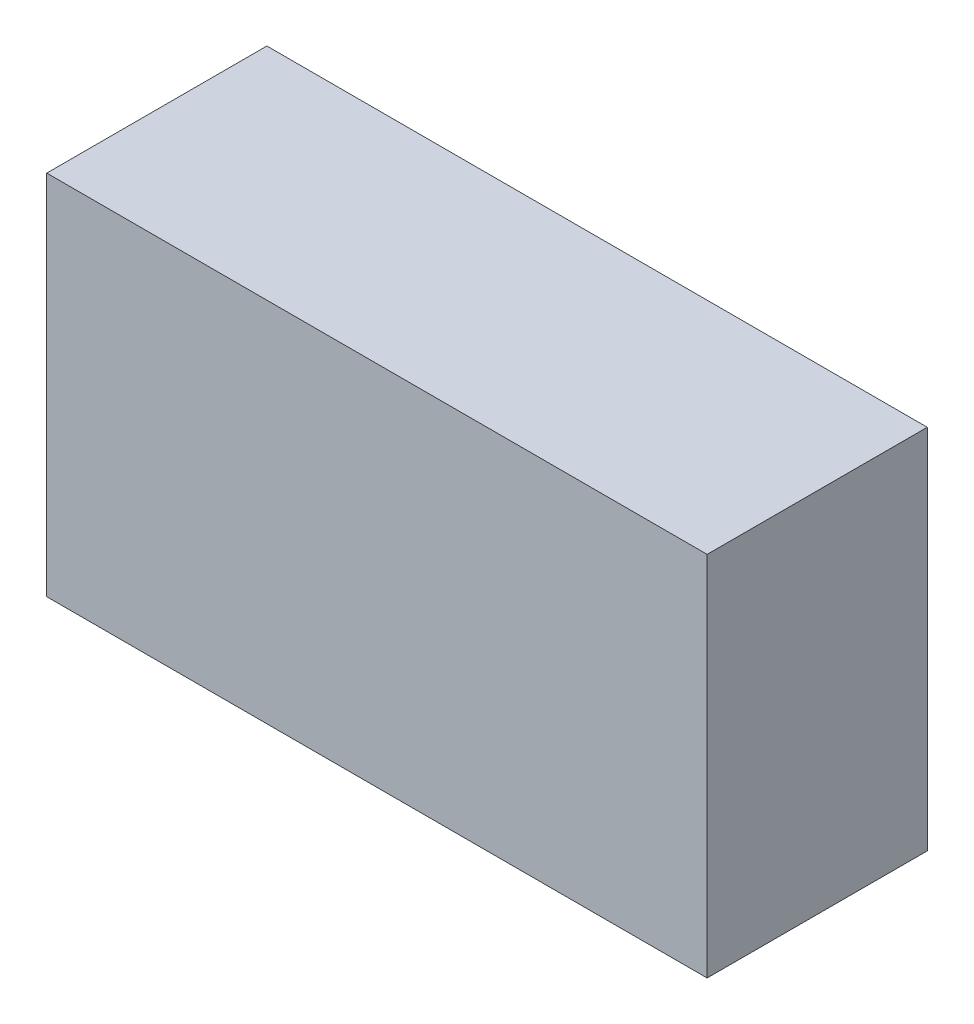
ISO-10303-21;
HEADER;
FILE_DESCRIPTION(('STEP AP214'),'2;1');
FILE_NAME('part.step','',(''),(''),'','','');
FILE_SCHEMA(('AUTOMOTIVE_DESIGN { 1 0 10303 214 1 1 1 1 }'));
ENDSEC;
DATA;
#1=APPLICATION_CONTEXT('core data for automotive mechanical design processes');
#2=APPLICATION_PROTOCOL_DEFINITION('international standard','automotive_design',2000,#1);
#3=PRODUCT_CONTEXT('',#1,'mechanical');
#4=PRODUCT('Part','Part','',(#3));
#5=PRODUCT_RELATED_PRODUCT_CATEGORY('part','',(#4));
#6=PRODUCT_DEFINITION_FORMATION('','',#4);
#7=PRODUCT_DEFINITION_CONTEXT('part definition',#1,'design');
#8=PRODUCT_DEFINITION('design','',#6,#7);
#9=PRODUCT_DEFINITION_SHAPE('','',#8);
#10=(LENGTH_UNIT() NAMED_UNIT(*) SI_UNIT(.MILLI.,.METRE.));
#11=(NAMED_UNIT(*) PLANE_ANGLE_UNIT() SI_UNIT($,.RADIAN.));
#12=(NAMED_UNIT(*) SI_UNIT($,.STERADIAN.) SOLID_ANGLE_UNIT());
#13=UNCERTAINTY_MEASURE_WITH_UNIT(LENGTH_MEASURE(1.E-05),#10,'distance_accuracy_value','');
#14=(GEOMETRIC_REPRESENTATION_CONTEXT(3) GLOBAL_UNCERTAINTY_ASSIGNED_CONTEXT((#13)) GLOBAL_UNIT_ASSIGNED_CONTEXT((#10,
#11,#12)) REPRESENTATION_CONTEXT('',''));
#15=CARTESIAN_POINT('',(0.,0.,0.));
#16=DIRECTION('',(0.,0.,1.));
#17=DIRECTION('',(1.,0.,0.));
#18=AXIS2_PLACEMENT_3D('',#15,#16,#17);
#19=CARTESIAN_POINT('',(0.45,-0.25,0.));
#20=DIRECTION('',(1.,0.,0.));
#21=DIRECTION('',(0.,1.,0.));
#22=AXIS2_PLACEMENT_3D('',#19,#20,#21);
#23=PLANE('',#22);
#24=DIRECTION('',(0.,-1.,0.));
#25=VECTOR('',#24,1.);
#26=CARTESIAN_POINT('',(0.45,0.25,0.));
#27=LINE('',#26,#25);
#28=CARTESIAN_POINT('',(0.45,0.25,0.));
#29=VERTEX_POINT('',#28);
#30=CARTESIAN_POINT('',(0.45,-0.25,0.));
#31=VERTEX_POINT('',#30);
#32=EDGE_CURVE('E38',#29,#31,#27,.T.);
#33=ORIENTED_EDGE('',*,*,#32,.F.);
#34=DIRECTION('',(0.,0.,1.));
#35=VECTOR('',#34,1.);
#36=CARTESIAN_POINT('',(0.45,0.25,0.));
#37=LINE('',#36,#35);
#38=CARTESIAN_POINT('',(0.45,0.25,0.3));
#39=VERTEX_POINT('',#38);
#40=EDGE_CURVE('E11',#29,#39,#37,.T.);
#41=ORIENTED_EDGE('',*,*,#40,.T.);
#42=DIRECTION('',(0.,1.,0.));
#43=VECTOR('',#42,1.);
#44=CARTESIAN_POINT('',(0.45,0.25,0.3));
#45=LINE('',#44,#43);
#46=CARTESIAN_POINT('',(0.45,-0.25,0.3));
#47=VERTEX_POINT('',#46);
#48=EDGE_CURVE('E51',#47,#39,#45,.T.);
#49=ORIENTED_EDGE('',*,*,#48,.F.);
#50=DIRECTION('',(0.,0.,1.));
#51=VECTOR('',#50,1.);
#52=CARTESIAN_POINT('',(0.45,-0.25,0.));
#53=LINE('',#52,#51);
#54=EDGE_CURVE('E26',#31,#47,#53,.T.);
#55=ORIENTED_EDGE('',*,*,#54,.F.);
#56=EDGE_LOOP('',(#33,#41,#49,#55));
#57=FACE_BOUND('',#56,.T.);
#58=ADVANCED_FACE('F16',(#57),#23,.T.);
#59=CARTESIAN_POINT('',(-0.45,-0.25,0.));
#60=DIRECTION('',(0.,-1.,0.));
#61=DIRECTION('',(-1.,0.,0.));
#62=AXIS2_PLACEMENT_3D('',#59,#60,#61);
#63=PLANE('',#62);
#64=DIRECTION('',(-1.,0.,0.));
#65=VECTOR('',#64,1.);
#66=CARTESIAN_POINT('',(0.45,-0.25,0.));
#67=LINE('',#66,#65);
#68=CARTESIAN_POINT('',(-0.45,-0.25,0.));
#69=VERTEX_POINT('',#68);
#70=EDGE_CURVE('E67',#31,#69,#67,.T.);
#71=ORIENTED_EDGE('',*,*,#70,.F.);
#72=ORIENTED_EDGE('',*,*,#54,.T.);
#73=DIRECTION('',(1.,0.,0.));
#74=VECTOR('',#73,1.);
#75=CARTESIAN_POINT('',(0.45,-0.25,0.3));
#76=LINE('',#75,#74);
#77=CARTESIAN_POINT('',(-0.45,-0.25,0.3));
#78=VERTEX_POINT('',#77);
#79=EDGE_CURVE('E88',#78,#47,#76,.T.);
#80=ORIENTED_EDGE('',*,*,#79,.F.);
#81=DIRECTION('',(0.,0.,1.));
#82=VECTOR('',#81,1.);
#83=CARTESIAN_POINT('',(-0.45,-0.25,0.));
#84=LINE('',#83,#82);
#85=EDGE_CURVE('E85',#69,#78,#84,.T.);
#86=ORIENTED_EDGE('',*,*,#85,.F.);
#87=EDGE_LOOP('',(#71,#72,#80,#86));
#88=FACE_BOUND('',#87,.T.);
#89=ADVANCED_FACE('F189',(#88),#63,.T.);
#90=CARTESIAN_POINT('',(-0.45,0.25,0.));
#91=DIRECTION('',(-1.,0.,0.));
#92=DIRECTION('',(0.,0.,1.));
#93=AXIS2_PLACEMENT_3D('',#90,#91,#92);
#94=PLANE('',#93);
#95=DIRECTION('',(0.,1.,0.));
#96=VECTOR('',#95,1.);
#97=CARTESIAN_POINT('',(-0.45,-0.25,0.));
#98=LINE('',#97,#96);
#99=CARTESIAN_POINT('',(-0.45,0.25,0.));
#100=VERTEX_POINT('',#99);
#101=EDGE_CURVE('E98',#69,#100,#98,.T.);
#102=ORIENTED_EDGE('',*,*,#101,.F.);
#103=ORIENTED_EDGE('',*,*,#85,.T.);
#104=DIRECTION('',(0.,-1.,0.));
#105=VECTOR('',#104,1.);
#106=CARTESIAN_POINT('',(-0.45,-0.25,0.3));
#107=LINE('',#106,#105);
#108=CARTESIAN_POINT('',(-0.45,0.25,0.3));
#109=VERTEX_POINT('',#108);
#110=EDGE_CURVE('E80',#109,#78,#107,.T.);
#111=ORIENTED_EDGE('',*,*,#110,.F.);
#112=DIRECTION('',(0.,0.,1.));
#113=VECTOR('',#112,1.);
#114=CARTESIAN_POINT('',(-0.45,0.25,0.));
#115=LINE('',#114,#113);
#116=EDGE_CURVE('E20',#100,#109,#115,.T.);
#117=ORIENTED_EDGE('',*,*,#116,.F.);
#118=EDGE_LOOP('',(#102,#103,#111,#117));
#119=FACE_BOUND('',#118,.T.);
#120=ADVANCED_FACE('F83',(#119),#94,.T.);
#121=CARTESIAN_POINT('',(0.45,0.25,0.));
#122=DIRECTION('',(0.,1.,0.));
#123=DIRECTION('',(1.,0.,0.));
#124=AXIS2_PLACEMENT_3D('',#121,#122,#123);
#125=PLANE('',#124);
#126=DIRECTION('',(1.,0.,0.));
#127=VECTOR('',#126,1.);
#128=CARTESIAN_POINT('',(-0.45,0.25,0.));
#129=LINE('',#128,#127);
#130=EDGE_CURVE('E94',#100,#29,#129,.T.);
#131=ORIENTED_EDGE('',*,*,#130,.F.);
#132=ORIENTED_EDGE('',*,*,#116,.T.);
#133=DIRECTION('',(-1.,0.,0.));
#134=VECTOR('',#133,1.);
#135=CARTESIAN_POINT('',(-0.45,0.25,0.3));
#136=LINE('',#135,#134);
#137=EDGE_CURVE('E87',#39,#109,#136,.T.);
#138=ORIENTED_EDGE('',*,*,#137,.F.);
#139=ORIENTED_EDGE('',*,*,#40,.F.);
#140=EDGE_LOOP('',(#131,#132,#138,#139));
#141=FACE_BOUND('',#140,.T.);
#142=ADVANCED_FACE('F92',(#141),#125,.T.);
#143=CARTESIAN_POINT('',(0.,0.,0.));
#144=DIRECTION('',(0.,0.,1.));
#145=DIRECTION('',(1.,0.,0.));
#146=AXIS2_PLACEMENT_3D('',#143,#144,#145);
#147=PLANE('',#146);
#148=ORIENTED_EDGE('',*,*,#130,.T.);
#149=ORIENTED_EDGE('',*,*,#32,.T.);
#150=ORIENTED_EDGE('',*,*,#70,.T.);
#151=ORIENTED_EDGE('',*,*,#101,.T.);
#152=EDGE_LOOP('',(#148,#149,#150,#151));
#153=FACE_BOUND('',#152,.T.);
#154=ADVANCED_FACE('F18',(#153),#147,.F.);
#155=CARTESIAN_POINT('',(0.,0.,0.3));
#156=DIRECTION('',(0.,0.,1.));
#157=DIRECTION('',(1.,0.,0.));
#158=AXIS2_PLACEMENT_3D('',#155,#156,#157);
#159=PLANE('',#158);
#160=ORIENTED_EDGE('',*,*,#137,.T.);
#161=ORIENTED_EDGE('',*,*,#110,.T.);
#162=ORIENTED_EDGE('',*,*,#79,.T.);
#163=ORIENTED_EDGE('',*,*,#48,.T.);
#164=EDGE_LOOP('',(#160,#161,#162,#163));
#165=FACE_BOUND('',#164,.T.);
#166=ADVANCED_FACE('F96',(#165),#159,.T.);
#167=CLOSED_SHELL('',(#58,#89,#120,#142,#154,#166));
#168=MANIFOLD_SOLID_BREP('B1',#167);
#169=ADVANCED_BREP_SHAPE_REPRESENTATION('',(#18,#168),#14);
#170=SHAPE_DEFINITION_REPRESENTATION(#9,#169);
ENDSEC;
END-ISO-10303-21;
